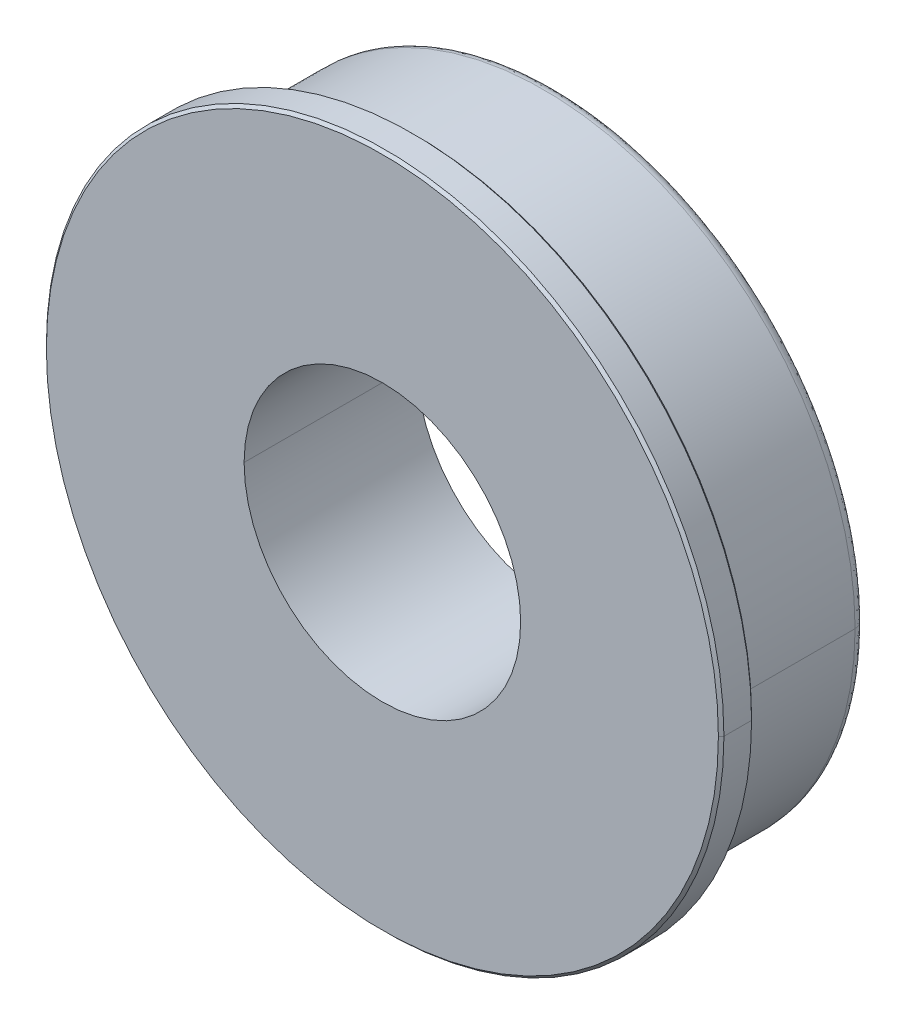
ISO-10303-21;
HEADER;
FILE_DESCRIPTION(('STEP AP214'),'2;1');
FILE_NAME('part.step','',(''),(''),'','','');
FILE_SCHEMA(('AUTOMOTIVE_DESIGN { 1 0 10303 214 1 1 1 1 }'));
ENDSEC;
DATA;
#1=APPLICATION_CONTEXT('core data for automotive mechanical design processes');
#2=APPLICATION_PROTOCOL_DEFINITION('international standard','automotive_design',2000,#1);
#3=PRODUCT_CONTEXT('',#1,'mechanical');
#4=PRODUCT('Part','Part','',(#3));
#5=PRODUCT_RELATED_PRODUCT_CATEGORY('part','',(#4));
#6=PRODUCT_DEFINITION_FORMATION('','',#4);
#7=PRODUCT_DEFINITION_CONTEXT('part definition',#1,'design');
#8=PRODUCT_DEFINITION('design','',#6,#7);
#9=PRODUCT_DEFINITION_SHAPE('','',#8);
#10=(LENGTH_UNIT() NAMED_UNIT(*) SI_UNIT(.MILLI.,.METRE.));
#11=(NAMED_UNIT(*) PLANE_ANGLE_UNIT() SI_UNIT($,.RADIAN.));
#12=(NAMED_UNIT(*) SI_UNIT($,.STERADIAN.) SOLID_ANGLE_UNIT());
#13=UNCERTAINTY_MEASURE_WITH_UNIT(LENGTH_MEASURE(1.E-05),#10,'distance_accuracy_value','');
#14=(GEOMETRIC_REPRESENTATION_CONTEXT(3) GLOBAL_UNCERTAINTY_ASSIGNED_CONTEXT((#13)) GLOBAL_UNIT_ASSIGNED_CONTEXT((#10,
#11,#12)) REPRESENTATION_CONTEXT('',''));
#15=CARTESIAN_POINT('',(0.,0.,0.));
#16=DIRECTION('',(0.,0.,1.));
#17=DIRECTION('',(1.,0.,0.));
#18=AXIS2_PLACEMENT_3D('',#15,#16,#17);
#19=CARTESIAN_POINT('',(0.,0.,-57.007125));
#20=DIRECTION('',(0.,0.,-1.));
#21=DIRECTION('',(-1.,0.,0.));
#22=AXIS2_PLACEMENT_3D('',#19,#20,#21);
#23=CYLINDRICAL_SURFACE('',#22,13.97);
#24=DIRECTION('',(0.,0.,-1.));
#25=VECTOR('',#24,1.);
#26=CARTESIAN_POINT('',(13.97,0.,-57.007125));
#27=LINE('',#26,#25);
#28=CARTESIAN_POINT('',(13.97,0.,6.40334));
#29=VERTEX_POINT('',#28);
#30=CARTESIAN_POINT('',(13.97,0.,5.89534));
#31=VERTEX_POINT('',#30);
#32=EDGE_CURVE('E242',#29,#31,#27,.T.);
#33=ORIENTED_EDGE('',*,*,#32,.F.);
#34=CARTESIAN_POINT('',(0.,0.,6.40334));
#35=DIRECTION('',(0.,0.,1.));
#36=DIRECTION('',(-1.,0.,0.));
#37=AXIS2_PLACEMENT_3D('',#34,#35,#36);
#38=CIRCLE('',#37,13.97);
#39=CARTESIAN_POINT('',(-13.97,0.,6.40334));
#40=VERTEX_POINT('',#39);
#41=EDGE_CURVE('E28',#40,#29,#38,.T.);
#42=ORIENTED_EDGE('',*,*,#41,.F.);
#43=DIRECTION('',(0.,0.,-1.));
#44=VECTOR('',#43,1.);
#45=CARTESIAN_POINT('',(-13.97,0.,-57.007125));
#46=LINE('',#45,#44);
#47=CARTESIAN_POINT('',(-13.97,0.,5.89534));
#48=VERTEX_POINT('',#47);
#49=EDGE_CURVE('E261',#40,#48,#46,.T.);
#50=ORIENTED_EDGE('',*,*,#49,.T.);
#51=CARTESIAN_POINT('',(0.,0.,5.89534));
#52=DIRECTION('',(0.,0.,1.));
#53=DIRECTION('',(-1.,0.,0.));
#54=AXIS2_PLACEMENT_3D('',#51,#52,#53);
#55=CIRCLE('',#54,13.97);
#56=EDGE_CURVE('E11',#48,#31,#55,.T.);
#57=ORIENTED_EDGE('',*,*,#56,.T.);
#58=EDGE_LOOP('',(#33,#42,#50,#57));
#59=FACE_BOUND('',#58,.T.);
#60=ADVANCED_FACE('F17',(#59),#23,.T.);
#61=CARTESIAN_POINT('',(0.,47.3069264516129,5.89534));
#62=DIRECTION('',(0.,0.,-1.));
#63=DIRECTION('',(0.,-1.,0.));
#64=AXIS2_PLACEMENT_3D('',#61,#62,#63);
#65=PLANE('',#64);
#66=ORIENTED_EDGE('',*,*,#56,.F.);
#67=CARTESIAN_POINT('',(0.,0.,5.89534));
#68=DIRECTION('',(0.,0.,1.));
#69=DIRECTION('',(-1.,0.,0.));
#70=AXIS2_PLACEMENT_3D('',#67,#68,#69);
#71=CIRCLE('',#70,13.97);
#72=EDGE_CURVE('E246',#31,#48,#71,.T.);
#73=ORIENTED_EDGE('',*,*,#72,.F.);
#74=EDGE_LOOP('',(#66,#73));
#75=FACE_BOUND('',#74,.T.);
#76=CARTESIAN_POINT('',(0.,0.,5.89534));
#77=DIRECTION('',(0.,0.,-1.));
#78=DIRECTION('',(1.,0.,0.));
#79=AXIS2_PLACEMENT_3D('',#76,#77,#78);
#80=CIRCLE('',#79,14.2875);
#81=CARTESIAN_POINT('',(14.2875,0.,5.89534));
#82=VERTEX_POINT('',#81);
#83=CARTESIAN_POINT('',(-14.2875,0.,5.89534));
#84=VERTEX_POINT('',#83);
#85=EDGE_CURVE('E183',#82,#84,#80,.T.);
#86=ORIENTED_EDGE('',*,*,#85,.F.);
#87=CARTESIAN_POINT('',(0.,0.,5.89534));
#88=DIRECTION('',(0.,0.,-1.));
#89=DIRECTION('',(1.,0.,0.));
#90=AXIS2_PLACEMENT_3D('',#87,#88,#89);
#91=CIRCLE('',#90,14.2875);
#92=EDGE_CURVE('E185',#84,#82,#91,.T.);
#93=ORIENTED_EDGE('',*,*,#92,.F.);
#94=EDGE_LOOP('',(#86,#93));
#95=FACE_BOUND('',#94,.T.);
#96=ADVANCED_FACE('F184',(#75,#95),#65,.F.);
#97=CARTESIAN_POINT('',(0.,0.,6.40334));
#98=DIRECTION('',(0.,0.,-1.));
#99=DIRECTION('',(0.,-1.,0.));
#100=AXIS2_PLACEMENT_3D('',#97,#98,#99);
#101=PLANE('',#100);
#102=ORIENTED_EDGE('',*,*,#41,.T.);
#103=CARTESIAN_POINT('',(0.,0.,6.40334));
#104=DIRECTION('',(0.,0.,1.));
#105=DIRECTION('',(-1.,0.,0.));
#106=AXIS2_PLACEMENT_3D('',#103,#104,#105);
#107=CIRCLE('',#106,13.97);
#108=EDGE_CURVE('E194',#29,#40,#107,.T.);
#109=ORIENTED_EDGE('',*,*,#108,.T.);
#110=EDGE_LOOP('',(#102,#109));
#111=FACE_BOUND('',#110,.T.);
#112=CARTESIAN_POINT('',(0.,0.,6.40334));
#113=DIRECTION('',(0.,0.,1.));
#114=DIRECTION('',(1.,0.,0.));
#115=AXIS2_PLACEMENT_3D('',#112,#113,#114);
#116=CIRCLE('',#115,15.4305);
#117=CARTESIAN_POINT('',(15.4305,0.,6.40334));
#118=VERTEX_POINT('',#117);
#119=CARTESIAN_POINT('',(-15.4305,0.,6.40334));
#120=VERTEX_POINT('',#119);
#121=EDGE_CURVE('E236',#118,#120,#116,.T.);
#122=ORIENTED_EDGE('',*,*,#121,.F.);
#123=CARTESIAN_POINT('',(0.,0.,6.40334));
#124=DIRECTION('',(0.,0.,1.));
#125=DIRECTION('',(1.,0.,0.));
#126=AXIS2_PLACEMENT_3D('',#123,#124,#125);
#127=CIRCLE('',#126,15.4305);
#128=EDGE_CURVE('E187',#120,#118,#127,.T.);
#129=ORIENTED_EDGE('',*,*,#128,.F.);
#130=EDGE_LOOP('',(#122,#129));
#131=FACE_BOUND('',#130,.T.);
#132=ADVANCED_FACE('F436',(#111,#131),#101,.T.);
#133=CARTESIAN_POINT('',(0.,0.,6.40334));
#134=DIRECTION('',(0.,0.,1.));
#135=DIRECTION('',(1.,0.,0.));
#136=AXIS2_PLACEMENT_3D('',#133,#134,#135);
#137=CYLINDRICAL_SURFACE('',#136,14.2875);
#138=DIRECTION('',(0.,0.,1.));
#139=VECTOR('',#138,1.);
#140=CARTESIAN_POINT('',(-14.2875,0.,6.40334));
#141=LINE('',#140,#139);
#142=CARTESIAN_POINT('',(-14.2875,0.,0.508));
#143=VERTEX_POINT('',#142);
#144=EDGE_CURVE('E143',#143,#84,#141,.T.);
#145=ORIENTED_EDGE('',*,*,#144,.F.);
#146=CARTESIAN_POINT('',(0.,0.,0.508));
#147=DIRECTION('',(0.,0.,-1.));
#148=DIRECTION('',(-1.,0.,0.));
#149=AXIS2_PLACEMENT_3D('',#146,#147,#148);
#150=CIRCLE('',#149,14.2875);
#151=CARTESIAN_POINT('',(14.2875,0.,0.508));
#152=VERTEX_POINT('',#151);
#153=EDGE_CURVE('E191',#152,#143,#150,.T.);
#154=ORIENTED_EDGE('',*,*,#153,.F.);
#155=DIRECTION('',(0.,0.,1.));
#156=VECTOR('',#155,1.);
#157=CARTESIAN_POINT('',(14.2875,0.,6.40334));
#158=LINE('',#157,#156);
#159=EDGE_CURVE('E152',#152,#82,#158,.T.);
#160=ORIENTED_EDGE('',*,*,#159,.T.);
#161=ORIENTED_EDGE('',*,*,#85,.T.);
#162=EDGE_LOOP('',(#145,#154,#160,#161));
#163=FACE_BOUND('',#162,.T.);
#164=ADVANCED_FACE('F189',(#163),#137,.T.);
#165=CARTESIAN_POINT('',(0.,0.,6.53033999999968));
#166=DIRECTION('',(0.,0.,1.));
#167=DIRECTION('',(1.,0.,0.));
#168=AXIS2_PLACEMENT_3D('',#165,#166,#167);
#169=CONICAL_SURFACE('',#168,15.5575000000004,0.785398163400003);
#170=DIRECTION('',(-0.707106781188354,0.,0.707106781184742));
#171=VECTOR('',#170,1.);
#172=CARTESIAN_POINT('',(-15.5575000000003,0.,6.53033999999968));
#173=LINE('',#172,#171);
#174=CARTESIAN_POINT('',(-15.5575000000007,0.,6.53034));
#175=VERTEX_POINT('',#174);
#176=EDGE_CURVE('E231',#120,#175,#173,.T.);
#177=ORIENTED_EDGE('',*,*,#176,.F.);
#178=ORIENTED_EDGE('',*,*,#128,.T.);
#179=DIRECTION('',(0.707106781188354,0.,0.707106781184742));
#180=VECTOR('',#179,1.);
#181=CARTESIAN_POINT('',(15.5575000000004,0.,6.53033999999968));
#182=LINE('',#181,#180);
#183=CARTESIAN_POINT('',(15.5575000000007,0.,6.53034));
#184=VERTEX_POINT('',#183);
#185=EDGE_CURVE('E235',#118,#184,#182,.T.);
#186=ORIENTED_EDGE('',*,*,#185,.T.);
#187=CARTESIAN_POINT('',(0.,0.,6.53034));
#188=DIRECTION('',(0.,0.,1.));
#189=DIRECTION('',(1.,0.,0.));
#190=AXIS2_PLACEMENT_3D('',#187,#188,#189);
#191=CIRCLE('',#190,15.5575);
#192=EDGE_CURVE('E107',#175,#184,#191,.T.);
#193=ORIENTED_EDGE('',*,*,#192,.F.);
#194=EDGE_LOOP('',(#177,#178,#186,#193));
#195=FACE_BOUND('',#194,.T.);
#196=ADVANCED_FACE('F524',(#195),#169,.T.);
#197=CARTESIAN_POINT('',(-13.7795,0.,0.));
#198=CARTESIAN_POINT('',(-13.7795,27.559,0.));
#199=CARTESIAN_POINT('',(13.7795,27.559,0.));
#200=CARTESIAN_POINT('',(13.7795,0.,0.));
#201=CARTESIAN_POINT('',(-14.0770795103145,0.,0.));
#202=CARTESIAN_POINT('',(-14.0770795103144,28.1541590206289,0.));
#203=CARTESIAN_POINT('',(14.0770795103145,28.1541590206289,0.));
#204=CARTESIAN_POINT('',(14.0770795103145,0.,0.));
#205=CARTESIAN_POINT('',(-14.2875,0.,0.210420489685535));
#206=CARTESIAN_POINT('',(-14.2875,28.575,0.210420489685535));
#207=CARTESIAN_POINT('',(14.2875,28.575,0.210420489685535));
#208=CARTESIAN_POINT('',(14.2875,0.,0.210420489685535));
#209=CARTESIAN_POINT('',(-14.2875,0.,0.508));
#210=CARTESIAN_POINT('',(-14.2875,28.575,0.508));
#211=CARTESIAN_POINT('',(14.2875,28.575,0.508));
#212=CARTESIAN_POINT('',(14.2875,0.,0.508));
#213=(BOUNDED_SURFACE() B_SPLINE_SURFACE(3,3,((#197,#198,#199,#200),(#201,#202,#203,#204),(#205,
#206,#207,#208),(#209,#210,#211,#212)),.UNSPECIFIED.,.F.,.F.,
.F.) B_SPLINE_SURFACE_WITH_KNOTS((4,4),(4,4),(0.,1.),(0.,1.),
.UNSPECIFIED.) GEOMETRIC_REPRESENTATION_ITEM() RATIONAL_B_SPLINE_SURFACE(((1.,0.333333333333334,
0.333333333333334,1.),(0.804737854124368,0.268245951374789,0.268245951374789,0.804737854124368),
(0.804737854124368,0.268245951374789,0.268245951374789,0.804737854124368),(1.,0.333333333333334,
0.333333333333334,1.))) REPRESENTATION_ITEM('') SURFACE());
#214=CARTESIAN_POINT('',(13.7795,0.,0.508));
#215=DIRECTION('',(0.,-1.,0.));
#216=DIRECTION('',(1.,0.,0.));
#217=AXIS2_PLACEMENT_3D('',#214,#215,#216);
#218=CIRCLE('',#217,0.508);
#219=CARTESIAN_POINT('',(13.7795,0.,0.));
#220=VERTEX_POINT('',#219);
#221=EDGE_CURVE('E228',#220,#152,#218,.T.);
#222=CARTESIAN_POINT('',(-13.7795,0.,0.));
#223=CARTESIAN_POINT('',(-13.7794675552335,0.421497426390389,0.));
#224=CARTESIAN_POINT('',(-13.7506877621706,1.05104048127232,0.));
#225=CARTESIAN_POINT('',(-13.6668318665827,1.78077698040319,0.));
#226=CARTESIAN_POINT('',(-13.6123340512018,2.14446263041079,0.));
#227=CARTESIAN_POINT('',(-13.5819426766145,2.32600980552512,0.));
#228=CARTESIAN_POINT('',(-13.5682444160279,2.40375238416924,0.));
#229=CARTESIAN_POINT('',(-13.5589626010226,2.45556669136582,0.));
#230=CARTESIAN_POINT('',(-13.5545355796112,2.47990633622309,0.));
#231=CARTESIAN_POINT('',(-13.468188235856,2.94661659255423,0.));
#232=CARTESIAN_POINT('',(-13.3150573659751,3.59665927264688,0.));
#233=CARTESIAN_POINT('',(-13.0817543937862,4.33956822100092,0.));
#234=CARTESIAN_POINT('',(-12.9514403350264,4.70715415057277,0.));
#235=CARTESIAN_POINT('',(-12.8828676624802,4.8899799792074,0.));
#236=CARTESIAN_POINT('',(-12.8527474507105,4.96812666230411,0.));
#237=CARTESIAN_POINT('',(-12.832504659856,5.0201783969328,0.));
#238=CARTESIAN_POINT('',(-12.8227255948528,5.04511098862695,0.));
#239=CARTESIAN_POINT('',(-12.6406946886811,5.50496203890198,0.));
#240=CARTESIAN_POINT('',(-12.3523725033681,6.13807724856792,0.));
#241=CARTESIAN_POINT('',(-11.9611562114528,6.84856068196315,0.));
#242=CARTESIAN_POINT('',(-11.7518379632326,7.19676465419034,0.));
#243=CARTESIAN_POINT('',(-11.6591922635106,7.34448683990119,0.));
#244=CARTESIAN_POINT('',(-11.5967756016834,7.44263316635269,0.));
#245=CARTESIAN_POINT('',(-11.5658997282574,7.49053086321375,0.));
#246=CARTESIAN_POINT('',(-11.0130583441175,8.33621173367981,0.));
#247=CARTESIAN_POINT('',(-10.4159528191133,9.07115041118719,0.));
#248=CARTESIAN_POINT('',(-9.40739042748339,10.0797916314465,0.));
#249=CARTESIAN_POINT('',(-8.87983719275224,10.5556771559459,0.));
#250=CARTESIAN_POINT('',(-8.22363235079585,11.0611155346759,0.));
#251=CARTESIAN_POINT('',(-7.88534841279182,11.3013943740777,0.));
#252=CARTESIAN_POINT('',(-7.73818782857028,11.4017052302578,0.));
#253=CARTESIAN_POINT('',(-7.63959593827849,11.4679867367606,0.));
#254=CARTESIAN_POINT('',(-7.58897578524335,11.5015386025942,0.));
#255=CARTESIAN_POINT('',(-7.15068488898832,11.7881080007829,0.));
#256=CARTESIAN_POINT('',(-6.54997648985628,12.1389840471985,0.));
#257=CARTESIAN_POINT('',(-5.8205890836496,12.493710586804,0.));
#258=CARTESIAN_POINT('',(-5.4487551454081,12.6574166446368,0.));
#259=CARTESIAN_POINT('',(-5.26105311750281,12.7358553705608,0.));
#260=CARTESIAN_POINT('',(-5.180226878661,12.7687403310298,0.));
#261=CARTESIAN_POINT('',(-5.12625771663386,12.7905010521524,0.));
#262=CARTESIAN_POINT('',(-5.09811984490713,12.8017399192919,0.));
#263=CARTESIAN_POINT('',(-4.65682033841892,12.9764654976551,0.));
#264=CARTESIAN_POINT('',(-4.0247146582154,13.1919810037299,0.));
#265=CARTESIAN_POINT('',(-3.27134245992602,13.3888929381391,0.));
#266=CARTESIAN_POINT('',(-2.89067746793502,13.4737181996741,0.));
#267=CARTESIAN_POINT('',(-2.69935024872794,13.5127231540243,0.));
#268=CARTESIAN_POINT('',(-2.61713971409386,13.5287093466563,0.));
#269=CARTESIAN_POINT('',(-2.56228532323248,13.5392045381055,0.));
#270=CARTESIAN_POINT('',(-2.53324732644352,13.5446647616304,0.));
#271=CARTESIAN_POINT('',(-1.67896161734117,13.7027863230002,0.));
#272=CARTESIAN_POINT('',(-0.8424688671022,13.7794675754784,0.));
#273=CARTESIAN_POINT('',(0.421234433551105,13.7795162122608,0.));
#274=CARTESIAN_POINT('',(1.05058024380357,13.7507729119684,0.));
#275=CARTESIAN_POINT('',(1.78043180230164,13.666895728931,0.));
#276=CARTESIAN_POINT('',(2.14426127651821,13.6123713042383,0.));
#277=CARTESIAN_POINT('',(2.32590193736839,13.5819626335984,0.));
#278=CARTESIAN_POINT('',(2.40368920424887,13.5682561051184,0.));
#279=CARTESIAN_POINT('',(2.4555343309188,13.5589685881178,0.));
#280=CARTESIAN_POINT('',(2.47990633622272,13.5545355796114,0.));
#281=CARTESIAN_POINT('',(2.94661659256,13.4681882358536,0.));
#282=CARTESIAN_POINT('',(3.59665927265698,13.3150573659709,0.));
#283=CARTESIAN_POINT('',(4.33956822100851,13.081754393783,0.));
#284=CARTESIAN_POINT('',(4.70715415057719,12.9514403350245,0.));
#285=CARTESIAN_POINT('',(4.88997997920977,12.8828676624792,0.));
#286=CARTESIAN_POINT('',(4.96812666230549,12.8527474507099,0.));
#287=CARTESIAN_POINT('',(5.02017839693351,12.8325046598558,0.));
#288=CARTESIAN_POINT('',(5.04511098862672,12.8227255948529,0.));
#289=CARTESIAN_POINT('',(5.50496203890555,12.6406946886798,0.));
#290=CARTESIAN_POINT('',(6.13807724857419,12.3523725033659,0.));
#291=CARTESIAN_POINT('',(6.84856068196785,11.9611562114511,0.));
#292=CARTESIAN_POINT('',(7.19676465419308,11.7518379632316,0.));
#293=CARTESIAN_POINT('',(7.34448683990283,11.65919226351,0.));
#294=CARTESIAN_POINT('',(7.44263316635355,11.596775601683,0.));
#295=CARTESIAN_POINT('',(7.4905308632128,11.5658997282582,0.));
#296=CARTESIAN_POINT('',(8.33621173369492,11.0130583441055,0.));
#297=CARTESIAN_POINT('',(9.07115041119207,10.4159528191115,0.));
#298=CARTESIAN_POINT('',(10.079791631444,9.40739042748432,0.));
#299=CARTESIAN_POINT('',(10.5556771559417,8.87983719275384,0.));
#300=CARTESIAN_POINT('',(11.0611155346727,8.22363235079707,0.));
#301=CARTESIAN_POINT('',(11.3013943740759,7.88534841279254,0.));
#302=CARTESIAN_POINT('',(11.4017052302567,7.7381878285707,0.));
#303=CARTESIAN_POINT('',(11.46798673676,7.63959593827872,0.));
#304=CARTESIAN_POINT('',(11.5015386025944,7.58897578524274,0.));
#305=CARTESIAN_POINT('',(11.7881080007815,7.15068488899325,0.));
#306=CARTESIAN_POINT('',(12.138984047196,6.54997648986491,0.));
#307=CARTESIAN_POINT('',(12.4937105868021,5.82058908365607,0.));
#308=CARTESIAN_POINT('',(12.6574166446357,5.44875514541188,0.));
#309=CARTESIAN_POINT('',(12.7358553705602,5.26105311750484,0.));
#310=CARTESIAN_POINT('',(12.7687403310295,5.18022687866219,0.));
#311=CARTESIAN_POINT('',(12.7905010521522,5.12625771663448,0.));
#312=CARTESIAN_POINT('',(12.801739919292,5.098119844907,0.));
#313=CARTESIAN_POINT('',(12.9764654976537,4.65682033842118,0.));
#314=CARTESIAN_POINT('',(13.1919810037274,4.02471465821935,0.));
#315=CARTESIAN_POINT('',(13.3888929381372,3.27134245992899,0.));
#316=CARTESIAN_POINT('',(13.4737181996731,2.89067746793676,0.));
#317=CARTESIAN_POINT('',(13.5127231540237,2.69935024872888,0.));
#318=CARTESIAN_POINT('',(13.528709346656,2.61713971409441,0.));
#319=CARTESIAN_POINT('',(13.5392045381053,2.56228532323278,0.));
#320=CARTESIAN_POINT('',(13.5446647616305,2.53324732644276,0.));
#321=CARTESIAN_POINT('',(13.7027863229975,1.67896161736618,0.));
#322=CARTESIAN_POINT('',(13.7794675754757,0.842468867090245,0.));
#323=CARTESIAN_POINT('',(13.7795,0.,0.));
#324=(BOUNDED_CURVE() B_SPLINE_CURVE(3,(#222,#223,#224,#225,#226,#227,#228,#229,#230,#231,#232,
#233,#234,#235,#236,#237,#238,#239,#240,#241,#242,#243,#244,#245,#246,#247,#248,#249,#250,#251,
#252,#253,#254,#255,#256,#257,#258,#259,#260,#261,#262,#263,#264,#265,#266,#267,#268,#269,#270,
#271,#272,#273,#274,#275,#276,#277,#278,#279,#280,#281,#282,#283,#284,#285,#286,#287,#288,#289,
#290,#291,#292,#293,#294,#295,#296,#297,#298,#299,#300,#301,#302,#303,#304,#305,#306,#307,#308,
#309,#310,#311,#312,#313,#314,#315,#316,#317,#318,#319,#320,#321,#322,#323),.UNSPECIFIED.,.F.,
.F.) B_SPLINE_CURVE_WITH_KNOTS((4,1,1,1,1,2,2,1,1,1,1,2,2,1,1,1,2,2,2,1,1,1,2,2,1,1,1,1,2,2,1,1,
1,1,2,2,2,1,1,1,1,2,2,1,1,1,1,2,2,1,1,1,2,2,2,1,1,1,2,2,1,1,1,1,2,2,1,1,1,1,2,2,4),(0.,
0.0156249999999996,0.0234374999999994,0.0273437499999993,0.0292968749999992,0.0302734374999992,
0.0312499999999992,0.0468749999999988,0.0546874999999986,0.0585937499999985,0.0605468749999985,
0.0615234374999985,0.0624999999999985,0.0781249999999987,0.0859374999999988,0.0898437499999989,
0.0917968749999989,0.0937499999999989,0.125,0.140625,0.1484375,0.15234375,0.154296875,0.15625,
0.171875,0.1796875,0.18359375,0.185546875,0.1865234375,0.1875,0.203125,0.2109375,0.21484375,
0.216796875,0.217773437499999,0.21875,0.25,0.265625,0.2734375,0.27734375,0.279296875,
0.2802734375,0.28125,0.296875,0.3046875,0.308593750000001,0.310546875000001,0.311523437500001,
0.3125,0.328125,0.3359375,0.339843750000001,0.341796875000001,0.34375,0.375,0.390625,0.3984375,
0.402343750000002,0.404296875000002,0.40625,0.421875,0.4296875,0.433593750000002,
0.435546875000002,0.436523437500002,0.4375,0.453125,0.4609375,0.464843750000002,
0.466796875000002,0.467773437500002,0.46875,0.5),
.UNSPECIFIED.) CURVE() GEOMETRIC_REPRESENTATION_ITEM() RATIONAL_B_SPLINE_CURVE((1.,1.,1.,1.,1.,
1.,1.,1.,1.,1.,1.,1.,1.,1.,1.,1.,1.,1.,1.,1.,1.,1.,1.,1.,1.,1.,1.,1.,1.,1.,1.,1.,1.,1.,1.,1.,1.,
1.,1.,1.,1.,1.,1.,1.,1.,1.,1.,1.,1.,1.,1.,1.,1.,1.,1.,1.,1.,1.,1.,1.,1.,1.,1.,1.,1.,1.,1.,1.,1.,
1.,1.,1.,1.,1.,1.,1.,1.,1.,1.,1.,1.,1.,1.,1.,1.,1.,1.,1.,1.,1.,1.,1.,1.,1.,1.,1.,1.,1.,1.,1.,1.,1.)) REPRESENTATION_ITEM(''));
#325=CARTESIAN_POINT('',(-13.7795,0.,0.));
#326=VERTEX_POINT('',#325);
#327=EDGE_CURVE('E164',#326,#220,#324,.T.);
#328=CARTESIAN_POINT('',(-13.7795,0.,0.508));
#329=DIRECTION('',(0.,1.,0.));
#330=DIRECTION('',(-1.,0.,0.));
#331=AXIS2_PLACEMENT_3D('',#328,#329,#330);
#332=CIRCLE('',#331,0.508);
#333=EDGE_CURVE('E213',#326,#143,#332,.T.);
#334=CARTESIAN_POINT('',(0.,0.,0.508));
#335=DIRECTION('',(0.,0.,-1.));
#336=DIRECTION('',(-1.,0.,0.));
#337=AXIS2_PLACEMENT_3D('',#334,#335,#336);
#338=CIRCLE('',#337,14.2875);
#339=EDGE_CURVE('E21',#143,#152,#338,.T.);
#340=ORIENTED_EDGE('',*,*,#221,.F.);
#341=ORIENTED_EDGE('',*,*,#327,.F.);
#342=ORIENTED_EDGE('',*,*,#333,.T.);
#343=ORIENTED_EDGE('',*,*,#339,.T.);
#344=EDGE_LOOP('',(#340,#341,#342,#343));
#345=FACE_BOUND('',#344,.T.);
#346=ADVANCED_FACE('F485',(#345),#213,.T.);
#347=CARTESIAN_POINT('',(0.,0.,7.92734));
#348=DIRECTION('',(0.,0.,1.));
#349=DIRECTION('',(1.,0.,0.));
#350=AXIS2_PLACEMENT_3D('',#347,#348,#349);
#351=CYLINDRICAL_SURFACE('',#350,15.5575);
#352=DIRECTION('',(0.,0.,1.));
#353=VECTOR('',#352,1.);
#354=CARTESIAN_POINT('',(-15.5575,0.,7.92734));
#355=LINE('',#354,#353);
#356=CARTESIAN_POINT('',(-15.5575,0.,7.80034));
#357=VERTEX_POINT('',#356);
#358=EDGE_CURVE('E227',#175,#357,#355,.T.);
#359=ORIENTED_EDGE('',*,*,#358,.F.);
#360=ORIENTED_EDGE('',*,*,#192,.T.);
#361=DIRECTION('',(0.,0.,1.));
#362=VECTOR('',#361,1.);
#363=CARTESIAN_POINT('',(15.5575,0.,7.92734));
#364=LINE('',#363,#362);
#365=CARTESIAN_POINT('',(15.5575,0.,7.80034));
#366=VERTEX_POINT('',#365);
#367=EDGE_CURVE('E254',#184,#366,#364,.T.);
#368=ORIENTED_EDGE('',*,*,#367,.T.);
#369=CARTESIAN_POINT('',(0.,0.,7.80034));
#370=DIRECTION('',(0.,0.,1.));
#371=DIRECTION('',(-1.,0.,0.));
#372=AXIS2_PLACEMENT_3D('',#369,#370,#371);
#373=CIRCLE('',#372,15.5575);
#374=EDGE_CURVE('E117',#357,#366,#373,.T.);
#375=ORIENTED_EDGE('',*,*,#374,.F.);
#376=EDGE_LOOP('',(#359,#360,#368,#375));
#377=FACE_BOUND('',#376,.T.);
#378=ADVANCED_FACE('F481',(#377),#351,.T.);
#379=CARTESIAN_POINT('',(0.,0.,0.));
#380=DIRECTION('',(0.,0.,-1.));
#381=DIRECTION('',(0.,-1.,0.));
#382=AXIS2_PLACEMENT_3D('',#379,#380,#381);
#383=PLANE('',#382);
#384=CARTESIAN_POINT('',(0.,0.,0.));
#385=DIRECTION('',(0.,0.,1.));
#386=DIRECTION('',(-1.,0.,0.));
#387=AXIS2_PLACEMENT_3D('',#384,#385,#386);
#388=CIRCLE('',#387,6.35);
#389=CARTESIAN_POINT('',(-6.35,0.,0.));
#390=VERTEX_POINT('',#389);
#391=CARTESIAN_POINT('',(6.35,0.,0.));
#392=VERTEX_POINT('',#391);
#393=EDGE_CURVE('E282',#390,#392,#388,.T.);
#394=ORIENTED_EDGE('',*,*,#393,.T.);
#395=CARTESIAN_POINT('',(0.,0.,0.));
#396=DIRECTION('',(0.,0.,1.));
#397=DIRECTION('',(-1.,0.,0.));
#398=AXIS2_PLACEMENT_3D('',#395,#396,#397);
#399=CIRCLE('',#398,6.35);
#400=EDGE_CURVE('E59',#392,#390,#399,.T.);
#401=ORIENTED_EDGE('',*,*,#400,.T.);
#402=EDGE_LOOP('',(#394,#401));
#403=FACE_BOUND('',#402,.T.);
#404=ORIENTED_EDGE('',*,*,#327,.T.);
#405=CARTESIAN_POINT('',(13.7795,0.,0.));
#406=CARTESIAN_POINT('',(13.7795162122622,-0.421234433545117,0.));
#407=CARTESIAN_POINT('',(13.7507729119708,-1.0505802437931,0.));
#408=CARTESIAN_POINT('',(13.6668957289328,-1.78043180229378,0.));
#409=CARTESIAN_POINT('',(13.6123713042394,-2.14426127651363,0.));
#410=CARTESIAN_POINT('',(13.581962633599,-2.32590193736593,0.));
#411=CARTESIAN_POINT('',(13.5682561051188,-2.40368920424742,0.));
#412=CARTESIAN_POINT('',(13.558968588118,-2.45553433091805,0.));
#413=CARTESIAN_POINT('',(13.5545355796113,-2.47990633622322,0.));
#414=CARTESIAN_POINT('',(13.4681882358548,-2.9466165925518,0.));
#415=CARTESIAN_POINT('',(13.315057365973,-3.59665927264263,0.));
#416=CARTESIAN_POINT('',(13.0817543937846,-4.33956822099774,0.));
#417=CARTESIAN_POINT('',(12.9514403350255,-4.7071541505709,0.));
#418=CARTESIAN_POINT('',(12.8828676624797,-4.88997997920639,0.));
#419=CARTESIAN_POINT('',(12.8527474507102,-4.96812666230351,0.));
#420=CARTESIAN_POINT('',(12.8325046598559,-5.02017839693249,0.));
#421=CARTESIAN_POINT('',(12.8227255948526,-5.04511098862723,0.));
#422=CARTESIAN_POINT('',(12.6406946886852,-5.50496203889733,0.));
#423=CARTESIAN_POINT('',(12.3523725033752,-6.13807724855982,0.));
#424=CARTESIAN_POINT('',(11.9611562114581,-6.84856068195707,0.));
#425=CARTESIAN_POINT('',(11.7518379632357,-7.19676465418679,0.));
#426=CARTESIAN_POINT('',(11.6591922635124,-7.34448683989904,0.));
#427=CARTESIAN_POINT('',(11.5967756016843,-7.44263316635155,0.));
#428=CARTESIAN_POINT('',(11.5658997282582,-7.4905308632128,0.));
#429=CARTESIAN_POINT('',(11.0130583441056,-8.33621173369481,0.));
#430=CARTESIAN_POINT('',(10.41595281911,-9.07115041119353,0.));
#431=CARTESIAN_POINT('',(9.40739042748505,-10.0797916314433,0.));
#432=CARTESIAN_POINT('',(8.87983719275512,-10.5556771559404,0.));
#433=CARTESIAN_POINT('',(8.22363235079802,-11.0611155346717,0.));
#434=CARTESIAN_POINT('',(7.88534841279309,-11.3013943740753,0.));
#435=CARTESIAN_POINT('',(7.73818782857104,-11.4017052302563,0.));
#436=CARTESIAN_POINT('',(7.63959593827889,-11.4679867367598,0.));
#437=CARTESIAN_POINT('',(7.58897578524338,-11.5015386025939,0.));
#438=CARTESIAN_POINT('',(7.15068488898815,-11.788108000785,0.));
#439=CARTESIAN_POINT('',(6.54997648985598,-12.1389840472023,0.));
#440=CARTESIAN_POINT('',(5.82058908364938,-12.4937105868068,0.));
#441=CARTESIAN_POINT('',(5.44875514540798,-12.6574166446385,0.));
#442=CARTESIAN_POINT('',(5.26105311750275,-12.7358553705617,0.));
#443=CARTESIAN_POINT('',(5.18022687866097,-12.7687403310303,0.));
#444=CARTESIAN_POINT('',(5.12625771663385,-12.7905010521526,0.));
#445=CARTESIAN_POINT('',(5.09811984490809,-12.8017399192917,0.));
#446=CARTESIAN_POINT('',(4.65682033840379,-12.9764654976591,0.));
#447=CARTESIAN_POINT('',(4.02471465818891,-13.1919810037368,0.));
#448=CARTESIAN_POINT('',(3.27134245990616,-13.3888929381443,0.));
#449=CARTESIAN_POINT('',(2.89067746792344,-13.4737181996772,0.));
#450=CARTESIAN_POINT('',(2.69935024872175,-13.5127231540259,0.));
#451=CARTESIAN_POINT('',(2.61713971409023,-13.5287093466573,0.));
#452=CARTESIAN_POINT('',(2.56228532323063,-13.5392045381059,0.));
#453=CARTESIAN_POINT('',(2.53324732644344,-13.5446647616305,0.));
#454=CARTESIAN_POINT('',(1.67896161734411,-13.7027863229975,0.));
#455=CARTESIAN_POINT('',(0.842468867097374,-13.7794675754757,0.));
#456=CARTESIAN_POINT('',(-0.421234433548683,-13.7795162122622,0.));
#457=CARTESIAN_POINT('',(-1.05058024379934,-13.7507729119708,0.));
#458=CARTESIAN_POINT('',(-1.78043180229845,-13.6668957289328,0.));
#459=CARTESIAN_POINT('',(-2.14426127651636,-13.6123713042393,0.));
#460=CARTESIAN_POINT('',(-2.32590193736739,-13.581962633599,0.));
#461=CARTESIAN_POINT('',(-2.40368920424828,-13.5682561051187,0.));
#462=CARTESIAN_POINT('',(-2.45553433091849,-13.5589685881179,0.));
#463=CARTESIAN_POINT('',(-2.47990633622205,-13.5545355796115,0.));
#464=CARTESIAN_POINT('',(-2.94661659257077,-13.4681882358506,0.));
#465=CARTESIAN_POINT('',(-3.59665927267583,-13.3150573659656,0.));
#466=CARTESIAN_POINT('',(-4.33956822102263,-13.0817543937791,0.));
#467=CARTESIAN_POINT('',(-4.70715415058543,-12.9514403350222,0.));
#468=CARTESIAN_POINT('',(-4.88997997921418,-12.882867662478,0.));
#469=CARTESIAN_POINT('',(-4.96812666230807,-12.8527474507091,0.));
#470=CARTESIAN_POINT('',(-5.02017839693483,-12.8325046598554,0.));
#471=CARTESIAN_POINT('',(-5.0451109886264,-12.8227255948531,0.));
#472=CARTESIAN_POINT('',(-5.50496203891068,-12.6406946886764,0.));
#473=CARTESIAN_POINT('',(-6.13807724858317,-12.3523725033599,0.));
#474=CARTESIAN_POINT('',(-6.84856068197457,-11.9611562114467,0.));
#475=CARTESIAN_POINT('',(-7.196764654197,-11.751837963229,0.));
#476=CARTESIAN_POINT('',(-7.34448683990519,-11.6591922635084,0.));
#477=CARTESIAN_POINT('',(-7.44263316635478,-11.5967756016822,0.));
#478=CARTESIAN_POINT('',(-7.49053086321308,-11.565899728258,0.));
#479=CARTESIAN_POINT('',(-8.33621173369039,-11.0130583441085,0.));
#480=CARTESIAN_POINT('',(-9.0711504112009,-10.4159528191011,0.));
#481=CARTESIAN_POINT('',(-10.0797916314396,-9.40739042748948,0.));
#482=CARTESIAN_POINT('',(-10.5556771559339,-8.87983719276289,0.));
#483=CARTESIAN_POINT('',(-11.0611155346669,-8.22363235080384,0.));
#484=CARTESIAN_POINT('',(-11.3013943740725,-7.88534841279649,0.));
#485=CARTESIAN_POINT('',(-11.4017052302547,-7.73818782857308,0.));
#486=CARTESIAN_POINT('',(-11.4679867367589,-7.63959593827996,0.));
#487=CARTESIAN_POINT('',(-11.5015386025944,-7.58897578524255,0.));
#488=CARTESIAN_POINT('',(-11.7881080007815,-7.15068488899471,0.));
#489=CARTESIAN_POINT('',(-12.1389840471961,-6.54997648986748,0.));
#490=CARTESIAN_POINT('',(-12.4937105868022,-5.82058908365799,0.));
#491=CARTESIAN_POINT('',(-12.6574166446358,-5.448755145413,0.));
#492=CARTESIAN_POINT('',(-12.7358553705602,-5.26105311750544,0.));
#493=CARTESIAN_POINT('',(-12.7687403310295,-5.18022687866254,0.));
#494=CARTESIAN_POINT('',(-12.7905010521522,-5.12625771663465,0.));
#495=CARTESIAN_POINT('',(-12.801739919292,-5.09811984490717,0.));
#496=CARTESIAN_POINT('',(-12.9764654976542,-4.65682033841831,0.));
#497=CARTESIAN_POINT('',(-13.1919810037283,-4.02471465821433,0.));
#498=CARTESIAN_POINT('',(-13.3888929381379,-3.27134245992523,0.));
#499=CARTESIAN_POINT('',(-13.4737181996735,-2.89067746793455,0.));
#500=CARTESIAN_POINT('',(-13.5127231540239,-2.6993502487277,0.));
#501=CARTESIAN_POINT('',(-13.5287093466561,-2.61713971409371,0.));
#502=CARTESIAN_POINT('',(-13.5392045381053,-2.56228532323241,0.));
#503=CARTESIAN_POINT('',(-13.5446617205483,-2.53326375654262,0.));
#504=CARTESIAN_POINT('',(-13.7028836376273,-1.67843585416977,0.));
#505=CARTESIAN_POINT('',(-13.7795648629285,-0.84264922726539,0.));
#506=CARTESIAN_POINT('',(-13.7795,0.,0.));
#507=(BOUNDED_CURVE() B_SPLINE_CURVE(3,(#405,#406,#407,#408,#409,#410,#411,#412,#413,#414,#415,
#416,#417,#418,#419,#420,#421,#422,#423,#424,#425,#426,#427,#428,#429,#430,#431,#432,#433,#434,
#435,#436,#437,#438,#439,#440,#441,#442,#443,#444,#445,#446,#447,#448,#449,#450,#451,#452,#453,
#454,#455,#456,#457,#458,#459,#460,#461,#462,#463,#464,#465,#466,#467,#468,#469,#470,#471,#472,
#473,#474,#475,#476,#477,#478,#479,#480,#481,#482,#483,#484,#485,#486,#487,#488,#489,#490,#491,
#492,#493,#494,#495,#496,#497,#498,#499,#500,#501,#502,#503,#504,#505,#506),.UNSPECIFIED.,.F.,
.F.) B_SPLINE_CURVE_WITH_KNOTS((4,1,1,1,1,2,2,1,1,1,1,2,2,1,1,1,2,2,2,1,1,1,2,2,1,1,1,1,2,2,1,1,
1,1,2,2,2,1,1,1,1,2,2,1,1,1,1,2,2,1,1,1,2,2,2,1,1,1,2,2,1,1,1,1,2,2,1,1,1,1,2,2,4),(0.5,
0.515625,0.5234375,0.527343750000001,0.529296875000001,0.530273437500001,0.53125,0.546875,
0.5546875,0.558593750000001,0.560546875000001,0.561523437500001,0.5625,0.578125,0.5859375,
0.589843750000002,0.591796875000002,0.59375,0.625,0.640625,0.6484375,0.652343750000004,
0.654296875000004,0.65625,0.671875,0.6796875,0.683593750000004,0.685546875000004,
0.686523437500004,0.6875,0.703125,0.7109375,0.714843750000005,0.716796875000005,
0.717773437500005,0.71875,0.75,0.765625,0.7734375,0.777343750000004,0.779296875000004,
0.780273437500004,0.78125,0.796875,0.8046875,0.808593750000003,0.810546875000003,
0.811523437500003,0.8125,0.828125,0.8359375,0.839843750000002,0.841796875000002,0.84375,0.875,
0.890625,0.8984375,0.902343750000001,0.904296875000001,0.90625,0.921875,0.9296875,
0.933593750000001,0.935546875000001,0.936523437500001,0.9375,0.953125,0.9609375,
0.964843750000001,0.966796875000001,0.9677734375,0.96875,1.),
.UNSPECIFIED.) CURVE() GEOMETRIC_REPRESENTATION_ITEM() RATIONAL_B_SPLINE_CURVE((1.,1.,1.,1.,1.,
1.,1.,1.,1.,1.,1.,1.,1.,1.,1.,1.,1.,1.,1.,1.,1.,1.,1.,1.,1.,1.,1.,1.,1.,1.,1.,1.,1.,1.,1.,1.,1.,
1.,1.,1.,1.,1.,1.,1.,1.,1.,1.,1.,1.,1.,1.,1.,1.,1.,1.,1.,1.,1.,1.,1.,1.,1.,1.,1.,1.,1.,1.,1.,1.,
1.,1.,1.,1.,1.,1.,1.,1.,1.,1.,1.,1.,1.,1.,1.,1.,1.,1.,1.,1.,1.,1.,1.,1.,1.,1.,1.,1.,1.,1.,1.,1.,1.)) REPRESENTATION_ITEM(''));
#508=EDGE_CURVE('E205',#220,#326,#507,.T.);
#509=ORIENTED_EDGE('',*,*,#508,.T.);
#510=EDGE_LOOP('',(#404,#509));
#511=FACE_BOUND('',#510,.T.);
#512=ADVANCED_FACE('F473',(#403,#511),#383,.T.);
#513=CARTESIAN_POINT('',(0.,0.,7.80034));
#514=DIRECTION('',(0.,0.,-1.));
#515=DIRECTION('',(-1.,0.,0.));
#516=AXIS2_PLACEMENT_3D('',#513,#514,#515);
#517=CONICAL_SURFACE('',#516,15.5575,0.785398163400003);
#518=DIRECTION('',(0.707106781188354,0.,-0.707106781184742));
#519=VECTOR('',#518,1.);
#520=CARTESIAN_POINT('',(15.5575,0.,7.80034));
#521=LINE('',#520,#519);
#522=CARTESIAN_POINT('',(15.4304999999997,0.,7.92733999999967));
#523=VERTEX_POINT('',#522);
#524=EDGE_CURVE('E219',#523,#366,#521,.T.);
#525=ORIENTED_EDGE('',*,*,#524,.F.);
#526=CARTESIAN_POINT('',(0.,0.,7.92733999999967));
#527=DIRECTION('',(0.,0.,-1.));
#528=DIRECTION('',(-1.,0.,0.));
#529=AXIS2_PLACEMENT_3D('',#526,#527,#528);
#530=CIRCLE('',#529,15.4304999999997);
#531=CARTESIAN_POINT('',(-15.4304999999997,0.,7.92733999999967));
#532=VERTEX_POINT('',#531);
#533=EDGE_CURVE('E257',#523,#532,#530,.T.);
#534=ORIENTED_EDGE('',*,*,#533,.T.);
#535=DIRECTION('',(-0.707106781188354,0.,-0.707106781184742));
#536=VECTOR('',#535,1.);
#537=CARTESIAN_POINT('',(-15.5575,0.,7.80034));
#538=LINE('',#537,#536);
#539=EDGE_CURVE('E208',#532,#357,#538,.T.);
#540=ORIENTED_EDGE('',*,*,#539,.T.);
#541=ORIENTED_EDGE('',*,*,#374,.T.);
#542=EDGE_LOOP('',(#525,#534,#540,#541));
#543=FACE_BOUND('',#542,.T.);
#544=ADVANCED_FACE('F428',(#543),#517,.T.);
#545=CARTESIAN_POINT('',(0.,0.,7.92734));
#546=DIRECTION('',(0.,0.,-1.));
#547=DIRECTION('',(-1.,0.,0.));
#548=AXIS2_PLACEMENT_3D('',#545,#546,#547);
#549=CYLINDRICAL_SURFACE('',#548,6.35);
#550=DIRECTION('',(0.,0.,-1.));
#551=VECTOR('',#550,1.);
#552=CARTESIAN_POINT('',(6.35,0.,7.92734));
#553=LINE('',#552,#551);
#554=CARTESIAN_POINT('',(6.35,0.,7.92734));
#555=VERTEX_POINT('',#554);
#556=EDGE_CURVE('E275',#555,#392,#553,.T.);
#557=ORIENTED_EDGE('',*,*,#556,.F.);
#558=CARTESIAN_POINT('',(0.,0.,7.92734));
#559=DIRECTION('',(0.,0.,1.));
#560=DIRECTION('',(-1.,0.,0.));
#561=AXIS2_PLACEMENT_3D('',#558,#559,#560);
#562=CIRCLE('',#561,6.35);
#563=CARTESIAN_POINT('',(-6.35,0.,7.92734));
#564=VERTEX_POINT('',#563);
#565=EDGE_CURVE('E75',#555,#564,#562,.T.);
#566=ORIENTED_EDGE('',*,*,#565,.T.);
#567=DIRECTION('',(0.,0.,-1.));
#568=VECTOR('',#567,1.);
#569=CARTESIAN_POINT('',(-6.35,0.,7.92734));
#570=LINE('',#569,#568);
#571=EDGE_CURVE('E250',#564,#390,#570,.T.);
#572=ORIENTED_EDGE('',*,*,#571,.T.);
#573=ORIENTED_EDGE('',*,*,#400,.F.);
#574=EDGE_LOOP('',(#557,#566,#572,#573));
#575=FACE_BOUND('',#574,.T.);
#576=ADVANCED_FACE('F423',(#575),#549,.F.);
#577=CARTESIAN_POINT('',(0.,0.,7.92734));
#578=DIRECTION('',(0.,0.,-1.));
#579=DIRECTION('',(0.,-1.,0.));
#580=AXIS2_PLACEMENT_3D('',#577,#578,#579);
#581=PLANE('',#580);
#582=CARTESIAN_POINT('',(0.,0.,7.92734));
#583=DIRECTION('',(0.,0.,1.));
#584=DIRECTION('',(-1.,0.,0.));
#585=AXIS2_PLACEMENT_3D('',#582,#583,#584);
#586=CIRCLE('',#585,6.35);
#587=EDGE_CURVE('E216',#564,#555,#586,.T.);
#588=ORIENTED_EDGE('',*,*,#587,.F.);
#589=ORIENTED_EDGE('',*,*,#565,.F.);
#590=EDGE_LOOP('',(#588,#589));
#591=FACE_BOUND('',#590,.T.);
#592=CARTESIAN_POINT('',(0.,0.,7.92733999999967));
#593=DIRECTION('',(0.,0.,-1.));
#594=DIRECTION('',(-1.,0.,0.));
#595=AXIS2_PLACEMENT_3D('',#592,#593,#594);
#596=CIRCLE('',#595,15.4304999999997);
#597=EDGE_CURVE('E222',#532,#523,#596,.T.);
#598=ORIENTED_EDGE('',*,*,#597,.F.);
#599=ORIENTED_EDGE('',*,*,#533,.F.);
#600=EDGE_LOOP('',(#598,#599));
#601=FACE_BOUND('',#600,.T.);
#602=ADVANCED_FACE('F427',(#591,#601),#581,.F.);
#603=CARTESIAN_POINT('',(0.,0.,-57.007125));
#604=DIRECTION('',(0.,0.,-1.));
#605=DIRECTION('',(-1.,0.,0.));
#606=AXIS2_PLACEMENT_3D('',#603,#604,#605);
#607=CYLINDRICAL_SURFACE('',#606,13.97);
#608=ORIENTED_EDGE('',*,*,#108,.F.);
#609=ORIENTED_EDGE('',*,*,#32,.T.);
#610=ORIENTED_EDGE('',*,*,#72,.T.);
#611=ORIENTED_EDGE('',*,*,#49,.F.);
#612=EDGE_LOOP('',(#608,#609,#610,#611));
#613=FACE_BOUND('',#612,.T.);
#614=ADVANCED_FACE('F447',(#613),#607,.T.);
#615=CARTESIAN_POINT('',(0.,0.,6.40334));
#616=DIRECTION('',(0.,0.,1.));
#617=DIRECTION('',(1.,0.,0.));
#618=AXIS2_PLACEMENT_3D('',#615,#616,#617);
#619=CYLINDRICAL_SURFACE('',#618,14.2875);
#620=ORIENTED_EDGE('',*,*,#339,.F.);
#621=ORIENTED_EDGE('',*,*,#144,.T.);
#622=ORIENTED_EDGE('',*,*,#92,.T.);
#623=ORIENTED_EDGE('',*,*,#159,.F.);
#624=EDGE_LOOP('',(#620,#621,#622,#623));
#625=FACE_BOUND('',#624,.T.);
#626=ADVANCED_FACE('F196',(#625),#619,.T.);
#627=CARTESIAN_POINT('',(0.,0.,6.53033999999968));
#628=DIRECTION('',(0.,0.,1.));
#629=DIRECTION('',(1.,0.,0.));
#630=AXIS2_PLACEMENT_3D('',#627,#628,#629);
#631=CONICAL_SURFACE('',#630,15.5575000000004,0.785398163400003);
#632=ORIENTED_EDGE('',*,*,#121,.T.);
#633=ORIENTED_EDGE('',*,*,#176,.T.);
#634=CARTESIAN_POINT('',(0.,0.,6.53034));
#635=DIRECTION('',(0.,0.,1.));
#636=DIRECTION('',(1.,0.,0.));
#637=AXIS2_PLACEMENT_3D('',#634,#635,#636);
#638=CIRCLE('',#637,15.5575);
#639=EDGE_CURVE('E211',#184,#175,#638,.T.);
#640=ORIENTED_EDGE('',*,*,#639,.F.);
#641=ORIENTED_EDGE('',*,*,#185,.F.);
#642=EDGE_LOOP('',(#632,#633,#640,#641));
#643=FACE_BOUND('',#642,.T.);
#644=ADVANCED_FACE('F462',(#643),#631,.T.);
#645=CARTESIAN_POINT('',(0.,0.,7.92734));
#646=DIRECTION('',(0.,0.,1.));
#647=DIRECTION('',(1.,0.,0.));
#648=AXIS2_PLACEMENT_3D('',#645,#646,#647);
#649=CYLINDRICAL_SURFACE('',#648,15.5575);
#650=ORIENTED_EDGE('',*,*,#639,.T.);
#651=ORIENTED_EDGE('',*,*,#358,.T.);
#652=CARTESIAN_POINT('',(0.,0.,7.80034));
#653=DIRECTION('',(0.,0.,1.));
#654=DIRECTION('',(-1.,0.,0.));
#655=AXIS2_PLACEMENT_3D('',#652,#653,#654);
#656=CIRCLE('',#655,15.5575);
#657=EDGE_CURVE('E212',#366,#357,#656,.T.);
#658=ORIENTED_EDGE('',*,*,#657,.F.);
#659=ORIENTED_EDGE('',*,*,#367,.F.);
#660=EDGE_LOOP('',(#650,#651,#658,#659));
#661=FACE_BOUND('',#660,.T.);
#662=ADVANCED_FACE('F539',(#661),#649,.T.);
#663=CARTESIAN_POINT('',(0.,0.,7.80034));
#664=DIRECTION('',(0.,0.,-1.));
#665=DIRECTION('',(-1.,0.,0.));
#666=AXIS2_PLACEMENT_3D('',#663,#664,#665);
#667=CONICAL_SURFACE('',#666,15.5575,0.785398163400003);
#668=ORIENTED_EDGE('',*,*,#597,.T.);
#669=ORIENTED_EDGE('',*,*,#524,.T.);
#670=ORIENTED_EDGE('',*,*,#657,.T.);
#671=ORIENTED_EDGE('',*,*,#539,.F.);
#672=EDGE_LOOP('',(#668,#669,#670,#671));
#673=FACE_BOUND('',#672,.T.);
#674=ADVANCED_FACE('F19',(#673),#667,.T.);
#675=CARTESIAN_POINT('',(0.,0.,7.92734));
#676=DIRECTION('',(0.,0.,-1.));
#677=DIRECTION('',(-1.,0.,0.));
#678=AXIS2_PLACEMENT_3D('',#675,#676,#677);
#679=CYLINDRICAL_SURFACE('',#678,6.35);
#680=ORIENTED_EDGE('',*,*,#587,.T.);
#681=ORIENTED_EDGE('',*,*,#556,.T.);
#682=ORIENTED_EDGE('',*,*,#393,.F.);
#683=ORIENTED_EDGE('',*,*,#571,.F.);
#684=EDGE_LOOP('',(#680,#681,#682,#683));
#685=FACE_BOUND('',#684,.T.);
#686=ADVANCED_FACE('F413',(#685),#679,.F.);
#687=CARTESIAN_POINT('',(13.7795,0.,0.));
#688=CARTESIAN_POINT('',(13.7795,-27.559,0.));
#689=CARTESIAN_POINT('',(-13.7795,-27.559,0.));
#690=CARTESIAN_POINT('',(-13.7795,0.,0.));
#691=CARTESIAN_POINT('',(14.0770795103145,0.,0.));
#692=CARTESIAN_POINT('',(14.0770795103145,-28.1541590206289,0.));
#693=CARTESIAN_POINT('',(-14.0770795103144,-28.1541590206289,0.));
#694=CARTESIAN_POINT('',(-14.0770795103145,0.,0.));
#695=CARTESIAN_POINT('',(14.2875,0.,0.210420489685535));
#696=CARTESIAN_POINT('',(14.2875,-28.575,0.210420489685535));
#697=CARTESIAN_POINT('',(-14.2875,-28.575,0.210420489685535));
#698=CARTESIAN_POINT('',(-14.2875,0.,0.210420489685535));
#699=CARTESIAN_POINT('',(14.2875,0.,0.508));
#700=CARTESIAN_POINT('',(14.2875,-28.575,0.508));
#701=CARTESIAN_POINT('',(-14.2875,-28.575,0.508));
#702=CARTESIAN_POINT('',(-14.2875,0.,0.508));
#703=(BOUNDED_SURFACE() B_SPLINE_SURFACE(3,3,((#687,#688,#689,#690),(#691,#692,#693,#694),(#695,
#696,#697,#698),(#699,#700,#701,#702)),.UNSPECIFIED.,.F.,.F.,
.F.) B_SPLINE_SURFACE_WITH_KNOTS((4,4),(4,4),(0.,1.),(0.,1.),
.UNSPECIFIED.) GEOMETRIC_REPRESENTATION_ITEM() RATIONAL_B_SPLINE_SURFACE(((1.,0.333333333333334,
0.333333333333334,1.),(0.804737854124368,0.268245951374789,0.268245951374789,0.804737854124368),
(0.804737854124368,0.268245951374789,0.268245951374789,0.804737854124368),(1.,0.333333333333334,
0.333333333333334,1.))) REPRESENTATION_ITEM('') SURFACE());
#704=ORIENTED_EDGE('',*,*,#508,.F.);
#705=ORIENTED_EDGE('',*,*,#221,.T.);
#706=ORIENTED_EDGE('',*,*,#153,.T.);
#707=ORIENTED_EDGE('',*,*,#333,.F.);
#708=EDGE_LOOP('',(#704,#705,#706,#707));
#709=FACE_BOUND('',#708,.T.);
#710=ADVANCED_FACE('F408',(#709),#703,.T.);
#711=CLOSED_SHELL('',(#60,#96,#132,#164,#196,#346,#378,#512,#544,#576,#602,#614,#626,#644,#662,
#674,#686,#710));
#712=MANIFOLD_SOLID_BREP('B1',#711);
#713=ADVANCED_BREP_SHAPE_REPRESENTATION('',(#18,#712),#14);
#714=SHAPE_DEFINITION_REPRESENTATION(#9,#713);
ENDSEC;
END-ISO-10303-21;
